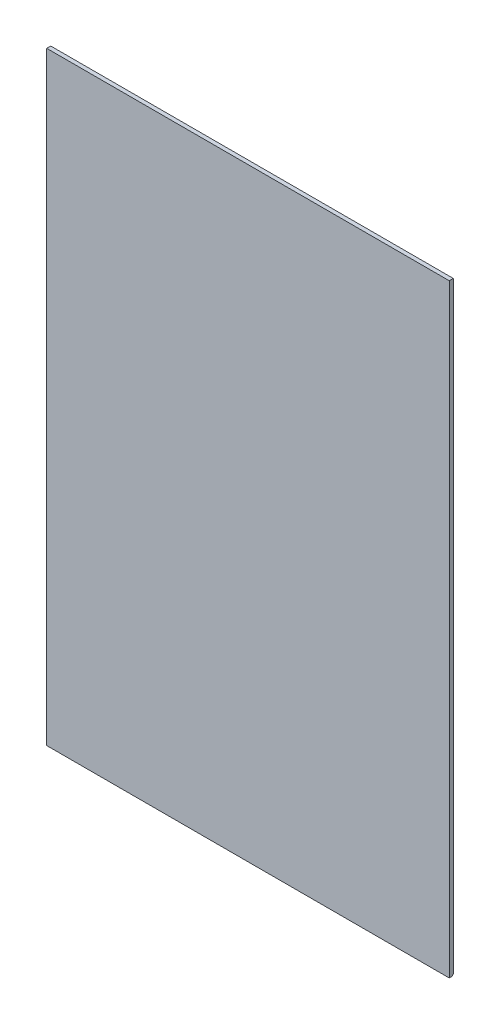
ISO-10303-21;
HEADER;
FILE_DESCRIPTION(('STEP AP214'),'2;1');
FILE_NAME('part.step','',(''),(''),'','','');
FILE_SCHEMA(('AUTOMOTIVE_DESIGN { 1 0 10303 214 1 1 1 1 }'));
ENDSEC;
DATA;
#1=APPLICATION_CONTEXT('core data for automotive mechanical design processes');
#2=APPLICATION_PROTOCOL_DEFINITION('international standard','automotive_design',2000,#1);
#3=PRODUCT_CONTEXT('',#1,'mechanical');
#4=PRODUCT('Part','Part','',(#3));
#5=PRODUCT_RELATED_PRODUCT_CATEGORY('part','',(#4));
#6=PRODUCT_DEFINITION_FORMATION('','',#4);
#7=PRODUCT_DEFINITION_CONTEXT('part definition',#1,'design');
#8=PRODUCT_DEFINITION('design','',#6,#7);
#9=PRODUCT_DEFINITION_SHAPE('','',#8);
#10=(LENGTH_UNIT() NAMED_UNIT(*) SI_UNIT(.MILLI.,.METRE.));
#11=(NAMED_UNIT(*) PLANE_ANGLE_UNIT() SI_UNIT($,.RADIAN.));
#12=(NAMED_UNIT(*) SI_UNIT($,.STERADIAN.) SOLID_ANGLE_UNIT());
#13=UNCERTAINTY_MEASURE_WITH_UNIT(LENGTH_MEASURE(1.E-05),#10,'distance_accuracy_value','');
#14=(GEOMETRIC_REPRESENTATION_CONTEXT(3) GLOBAL_UNCERTAINTY_ASSIGNED_CONTEXT((#13)) GLOBAL_UNIT_ASSIGNED_CONTEXT((#10,
#11,#12)) REPRESENTATION_CONTEXT('',''));
#15=CARTESIAN_POINT('',(0.,0.,0.));
#16=DIRECTION('',(0.,0.,1.));
#17=DIRECTION('',(1.,0.,0.));
#18=AXIS2_PLACEMENT_3D('',#15,#16,#17);
#19=CARTESIAN_POINT('',(50.,0.,0.5));
#20=DIRECTION('',(0.,1.,0.));
#21=DIRECTION('',(-1.,0.,0.));
#22=AXIS2_PLACEMENT_3D('',#19,#20,#21);
#23=PLANE('',#22);
#24=DIRECTION('',(0.,0.,-1.));
#25=VECTOR('',#24,1.);
#26=CARTESIAN_POINT('',(0.,0.,0.5));
#27=LINE('',#26,#25);
#28=CARTESIAN_POINT('',(0.,0.,0.5));
#29=VERTEX_POINT('',#28);
#30=CARTESIAN_POINT('',(0.,0.,0.25));
#31=VERTEX_POINT('',#30);
#32=EDGE_CURVE('E108',#29,#31,#27,.T.);
#33=ORIENTED_EDGE('',*,*,#32,.T.);
#34=DIRECTION('',(1.,0.,0.));
#35=VECTOR('',#34,1.);
#36=CARTESIAN_POINT('',(50.,0.,0.25));
#37=LINE('',#36,#35);
#38=CARTESIAN_POINT('',(50.,0.,0.25));
#39=VERTEX_POINT('',#38);
#40=EDGE_CURVE('E99',#31,#39,#37,.T.);
#41=ORIENTED_EDGE('',*,*,#40,.T.);
#42=DIRECTION('',(0.,0.,-1.));
#43=VECTOR('',#42,1.);
#44=CARTESIAN_POINT('',(50.,0.,0.5));
#45=LINE('',#44,#43);
#46=CARTESIAN_POINT('',(50.,0.,0.5));
#47=VERTEX_POINT('',#46);
#48=EDGE_CURVE('E80',#47,#39,#45,.T.);
#49=ORIENTED_EDGE('',*,*,#48,.F.);
#50=DIRECTION('',(1.,0.,0.));
#51=VECTOR('',#50,1.);
#52=CARTESIAN_POINT('',(50.,0.,0.5));
#53=LINE('',#52,#51);
#54=EDGE_CURVE('E86',#29,#47,#53,.T.);
#55=ORIENTED_EDGE('',*,*,#54,.F.);
#56=EDGE_LOOP('',(#33,#41,#49,#55));
#57=FACE_BOUND('',#56,.T.);
#58=ADVANCED_FACE('F32',(#57),#23,.F.);
#59=CARTESIAN_POINT('',(50.,75.,0.5));
#60=DIRECTION('',(-1.,0.,0.));
#61=DIRECTION('',(0.,-1.,0.));
#62=AXIS2_PLACEMENT_3D('',#59,#60,#61);
#63=PLANE('',#62);
#64=ORIENTED_EDGE('',*,*,#48,.T.);
#65=CARTESIAN_POINT('',(50.,0.250000000000006,0.25));
#66=DIRECTION('',(-1.,0.,0.));
#67=DIRECTION('',(0.,-1.,0.));
#68=AXIS2_PLACEMENT_3D('',#65,#66,#67);
#69=CIRCLE('',#68,0.25);
#70=CARTESIAN_POINT('',(50.,0.25,0.));
#71=VERTEX_POINT('',#70);
#72=EDGE_CURVE('E54',#39,#71,#69,.F.);
#73=ORIENTED_EDGE('',*,*,#72,.T.);
#74=DIRECTION('',(0.,1.,0.));
#75=VECTOR('',#74,1.);
#76=CARTESIAN_POINT('',(50.,75.,0.));
#77=LINE('',#76,#75);
#78=CARTESIAN_POINT('',(50.,75.,0.));
#79=VERTEX_POINT('',#78);
#80=EDGE_CURVE('E113',#71,#79,#77,.T.);
#81=ORIENTED_EDGE('',*,*,#80,.T.);
#82=DIRECTION('',(0.,0.,-1.));
#83=VECTOR('',#82,1.);
#84=CARTESIAN_POINT('',(50.,75.,0.5));
#85=LINE('',#84,#83);
#86=CARTESIAN_POINT('',(50.,75.,0.5));
#87=VERTEX_POINT('',#86);
#88=EDGE_CURVE('E82',#87,#79,#85,.T.);
#89=ORIENTED_EDGE('',*,*,#88,.F.);
#90=DIRECTION('',(0.,1.,0.));
#91=VECTOR('',#90,1.);
#92=CARTESIAN_POINT('',(50.,75.,0.5));
#93=LINE('',#92,#91);
#94=EDGE_CURVE('E76',#47,#87,#93,.T.);
#95=ORIENTED_EDGE('',*,*,#94,.F.);
#96=EDGE_LOOP('',(#64,#73,#81,#89,#95));
#97=FACE_BOUND('',#96,.T.);
#98=ADVANCED_FACE('F78',(#97),#63,.F.);
#99=CARTESIAN_POINT('',(0.,75.,0.5));
#100=DIRECTION('',(0.,-1.,0.));
#101=DIRECTION('',(0.,0.,-1.));
#102=AXIS2_PLACEMENT_3D('',#99,#100,#101);
#103=PLANE('',#102);
#104=DIRECTION('',(-1.,0.,0.));
#105=VECTOR('',#104,1.);
#106=CARTESIAN_POINT('',(0.,75.,0.));
#107=LINE('',#106,#105);
#108=CARTESIAN_POINT('',(0.,75.,0.));
#109=VERTEX_POINT('',#108);
#110=EDGE_CURVE('E111',#79,#109,#107,.T.);
#111=ORIENTED_EDGE('',*,*,#110,.T.);
#112=DIRECTION('',(0.,0.,-1.));
#113=VECTOR('',#112,1.);
#114=CARTESIAN_POINT('',(0.,75.,0.5));
#115=LINE('',#114,#113);
#116=CARTESIAN_POINT('',(0.,75.,0.5));
#117=VERTEX_POINT('',#116);
#118=EDGE_CURVE('E102',#117,#109,#115,.T.);
#119=ORIENTED_EDGE('',*,*,#118,.F.);
#120=DIRECTION('',(-1.,0.,0.));
#121=VECTOR('',#120,1.);
#122=CARTESIAN_POINT('',(0.,75.,0.5));
#123=LINE('',#122,#121);
#124=EDGE_CURVE('E85',#87,#117,#123,.T.);
#125=ORIENTED_EDGE('',*,*,#124,.F.);
#126=ORIENTED_EDGE('',*,*,#88,.T.);
#127=EDGE_LOOP('',(#111,#119,#125,#126));
#128=FACE_BOUND('',#127,.T.);
#129=ADVANCED_FACE('F118',(#128),#103,.F.);
#130=CARTESIAN_POINT('',(0.,0.,0.5));
#131=DIRECTION('',(1.,0.,0.));
#132=DIRECTION('',(0.,0.,-1.));
#133=AXIS2_PLACEMENT_3D('',#130,#131,#132);
#134=PLANE('',#133);
#135=DIRECTION('',(0.,-1.,0.));
#136=VECTOR('',#135,1.);
#137=CARTESIAN_POINT('',(0.,0.,0.));
#138=LINE('',#137,#136);
#139=CARTESIAN_POINT('',(0.,0.25,0.));
#140=VERTEX_POINT('',#139);
#141=EDGE_CURVE('E95',#109,#140,#138,.T.);
#142=ORIENTED_EDGE('',*,*,#141,.T.);
#143=CARTESIAN_POINT('',(0.,0.25,0.25));
#144=DIRECTION('',(1.,0.,0.));
#145=DIRECTION('',(0.,0.,-1.));
#146=AXIS2_PLACEMENT_3D('',#143,#144,#145);
#147=CIRCLE('',#146,0.25);
#148=EDGE_CURVE('E11',#140,#31,#147,.F.);
#149=ORIENTED_EDGE('',*,*,#148,.T.);
#150=ORIENTED_EDGE('',*,*,#32,.F.);
#151=DIRECTION('',(0.,-1.,0.));
#152=VECTOR('',#151,1.);
#153=CARTESIAN_POINT('',(0.,0.,0.5));
#154=LINE('',#153,#152);
#155=EDGE_CURVE('E91',#117,#29,#154,.T.);
#156=ORIENTED_EDGE('',*,*,#155,.F.);
#157=ORIENTED_EDGE('',*,*,#118,.T.);
#158=EDGE_LOOP('',(#142,#149,#150,#156,#157));
#159=FACE_BOUND('',#158,.T.);
#160=ADVANCED_FACE('F121',(#159),#134,.F.);
#161=CARTESIAN_POINT('',(0.,0.,0.5));
#162=DIRECTION('',(0.,0.,-1.));
#163=DIRECTION('',(-1.,0.,0.));
#164=AXIS2_PLACEMENT_3D('',#161,#162,#163);
#165=PLANE('',#164);
#166=ORIENTED_EDGE('',*,*,#54,.T.);
#167=ORIENTED_EDGE('',*,*,#94,.T.);
#168=ORIENTED_EDGE('',*,*,#124,.T.);
#169=ORIENTED_EDGE('',*,*,#155,.T.);
#170=EDGE_LOOP('',(#166,#167,#168,#169));
#171=FACE_BOUND('',#170,.T.);
#172=ADVANCED_FACE('F89',(#171),#165,.F.);
#173=CARTESIAN_POINT('',(0.,0.,0.));
#174=DIRECTION('',(0.,0.,-1.));
#175=DIRECTION('',(-1.,0.,0.));
#176=AXIS2_PLACEMENT_3D('',#173,#174,#175);
#177=PLANE('',#176);
#178=ORIENTED_EDGE('',*,*,#80,.F.);
#179=DIRECTION('',(1.,0.,0.));
#180=VECTOR('',#179,1.);
#181=CARTESIAN_POINT('',(0.,0.25,0.));
#182=LINE('',#181,#180);
#183=EDGE_CURVE('E40',#71,#140,#182,.F.);
#184=ORIENTED_EDGE('',*,*,#183,.T.);
#185=ORIENTED_EDGE('',*,*,#141,.F.);
#186=ORIENTED_EDGE('',*,*,#110,.F.);
#187=EDGE_LOOP('',(#178,#184,#185,#186));
#188=FACE_BOUND('',#187,.T.);
#189=ADVANCED_FACE('F125',(#188),#177,.T.);
#190=CARTESIAN_POINT('',(50.,0.250000000000006,0.25));
#191=DIRECTION('',(-1.,0.,0.));
#192=DIRECTION('',(0.,-1.,0.));
#193=AXIS2_PLACEMENT_3D('',#190,#191,#192);
#194=CYLINDRICAL_SURFACE('',#193,0.25);
#195=ORIENTED_EDGE('',*,*,#148,.F.);
#196=ORIENTED_EDGE('',*,*,#183,.F.);
#197=ORIENTED_EDGE('',*,*,#72,.F.);
#198=ORIENTED_EDGE('',*,*,#40,.F.);
#199=EDGE_LOOP('',(#195,#196,#197,#198));
#200=FACE_BOUND('',#199,.T.);
#201=ADVANCED_FACE('F34',(#200),#194,.T.);
#202=CLOSED_SHELL('',(#58,#98,#129,#160,#172,#189,#201));
#203=MANIFOLD_SOLID_BREP('B2',#202);
#204=ADVANCED_BREP_SHAPE_REPRESENTATION('',(#18,#203),#14);
#205=SHAPE_DEFINITION_REPRESENTATION(#9,#204);
ENDSEC;
END-ISO-10303-21;
